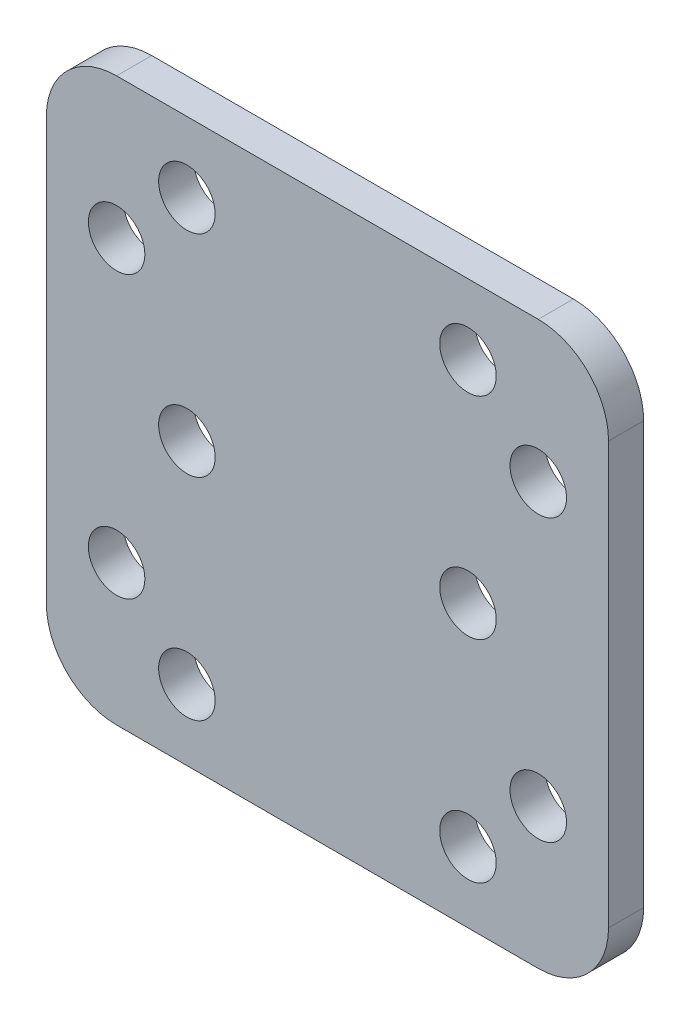
ISO-10303-21;
HEADER;
FILE_DESCRIPTION(('STEP AP214'),'2;1');
FILE_NAME('part.step','',(''),(''),'','','');
FILE_SCHEMA(('AUTOMOTIVE_DESIGN { 1 0 10303 214 1 1 1 1 }'));
ENDSEC;
DATA;
#1=APPLICATION_CONTEXT('core data for automotive mechanical design processes');
#2=APPLICATION_PROTOCOL_DEFINITION('international standard','automotive_design',2000,#1);
#3=PRODUCT_CONTEXT('',#1,'mechanical');
#4=PRODUCT('Part','Part','',(#3));
#5=PRODUCT_RELATED_PRODUCT_CATEGORY('part','',(#4));
#6=PRODUCT_DEFINITION_FORMATION('','',#4);
#7=PRODUCT_DEFINITION_CONTEXT('part definition',#1,'design');
#8=PRODUCT_DEFINITION('design','',#6,#7);
#9=PRODUCT_DEFINITION_SHAPE('','',#8);
#10=(LENGTH_UNIT() NAMED_UNIT(*) SI_UNIT(.MILLI.,.METRE.));
#11=(NAMED_UNIT(*) PLANE_ANGLE_UNIT() SI_UNIT($,.RADIAN.));
#12=(NAMED_UNIT(*) SI_UNIT($,.STERADIAN.) SOLID_ANGLE_UNIT());
#13=UNCERTAINTY_MEASURE_WITH_UNIT(LENGTH_MEASURE(1.E-05),#10,'distance_accuracy_value','');
#14=(GEOMETRIC_REPRESENTATION_CONTEXT(3) GLOBAL_UNCERTAINTY_ASSIGNED_CONTEXT((#13)) GLOBAL_UNIT_ASSIGNED_CONTEXT((#10,
#11,#12)) REPRESENTATION_CONTEXT('',''));
#15=CARTESIAN_POINT('',(0.,0.,0.));
#16=DIRECTION('',(0.,0.,1.));
#17=DIRECTION('',(1.,0.,0.));
#18=AXIS2_PLACEMENT_3D('',#15,#16,#17);
#19=CARTESIAN_POINT('',(6.34999999985809,2.37276864822889E-11,0.));
#20=DIRECTION('',(0.,0.,1.));
#21=DIRECTION('',(1.,0.,0.));
#22=AXIS2_PLACEMENT_3D('',#19,#20,#21);
#23=PLANE('',#22);
#24=CARTESIAN_POINT('',(-12.7000000001419,12.7000000000238,0.));
#25=DIRECTION('',(0.,0.,-1.));
#26=DIRECTION('',(-1.,0.,0.));
#27=AXIS2_PLACEMENT_3D('',#24,#25,#26);
#28=CIRCLE('',#27,2.5527);
#29=CARTESIAN_POINT('',(-10.1473000001419,12.7000000000238,0.));
#30=VERTEX_POINT('',#29);
#31=EDGE_CURVE('E186',#30,#30,#28,.T.);
#32=ORIENTED_EDGE('',*,*,#31,.F.);
#33=EDGE_LOOP('',(#32));
#34=FACE_BOUND('',#33,.T.);
#35=CARTESIAN_POINT('',(-6.35000000014201,19.0500000000238,0.));
#36=DIRECTION('',(0.,0.,-1.));
#37=DIRECTION('',(-1.,0.,0.));
#38=AXIS2_PLACEMENT_3D('',#35,#36,#37);
#39=CIRCLE('',#38,2.5527);
#40=CARTESIAN_POINT('',(-3.79730000014201,19.0500000000238,0.));
#41=VERTEX_POINT('',#40);
#42=EDGE_CURVE('E237',#41,#41,#39,.T.);
#43=ORIENTED_EDGE('',*,*,#42,.F.);
#44=EDGE_LOOP('',(#43));
#45=FACE_BOUND('',#44,.T.);
#46=CARTESIAN_POINT('',(19.0499999998582,19.0500000000238,0.));
#47=DIRECTION('',(0.,0.,-1.));
#48=DIRECTION('',(-1.,0.,0.));
#49=AXIS2_PLACEMENT_3D('',#46,#47,#48);
#50=CIRCLE('',#49,2.5527);
#51=CARTESIAN_POINT('',(21.6026999998582,19.0500000000238,0.));
#52=VERTEX_POINT('',#51);
#53=EDGE_CURVE('E228',#52,#52,#50,.T.);
#54=ORIENTED_EDGE('',*,*,#53,.F.);
#55=EDGE_LOOP('',(#54));
#56=FACE_BOUND('',#55,.T.);
#57=CARTESIAN_POINT('',(19.0499999998582,2.35908870584317E-11,0.));
#58=DIRECTION('',(0.,0.,-1.));
#59=DIRECTION('',(-1.,0.,0.));
#60=AXIS2_PLACEMENT_3D('',#57,#58,#59);
#61=CIRCLE('',#60,2.5527);
#62=CARTESIAN_POINT('',(21.6026999998582,2.35901822884954E-11,0.));
#63=VERTEX_POINT('',#62);
#64=EDGE_CURVE('E270',#63,#63,#61,.T.);
#65=ORIENTED_EDGE('',*,*,#64,.F.);
#66=EDGE_LOOP('',(#65));
#67=FACE_BOUND('',#66,.T.);
#68=CARTESIAN_POINT('',(25.3999999998581,12.7000000000238,0.));
#69=DIRECTION('',(0.,0.,-1.));
#70=DIRECTION('',(-1.,0.,0.));
#71=AXIS2_PLACEMENT_3D('',#68,#69,#70);
#72=CIRCLE('',#71,2.5527);
#73=CARTESIAN_POINT('',(27.952699999858,12.7000000000238,0.));
#74=VERTEX_POINT('',#73);
#75=EDGE_CURVE('E252',#74,#74,#72,.T.);
#76=ORIENTED_EDGE('',*,*,#75,.F.);
#77=EDGE_LOOP('',(#76));
#78=FACE_BOUND('',#77,.T.);
#79=CARTESIAN_POINT('',(25.3999999998581,-12.6999999999764,0.));
#80=DIRECTION('',(0.,0.,-1.));
#81=DIRECTION('',(-1.,0.,0.));
#82=AXIS2_PLACEMENT_3D('',#79,#80,#81);
#83=CIRCLE('',#82,2.5527);
#84=CARTESIAN_POINT('',(27.952699999858,-12.6999999999764,0.));
#85=VERTEX_POINT('',#84);
#86=EDGE_CURVE('E218',#85,#85,#83,.T.);
#87=ORIENTED_EDGE('',*,*,#86,.F.);
#88=EDGE_LOOP('',(#87));
#89=FACE_BOUND('',#88,.T.);
#90=CARTESIAN_POINT('',(19.0499999998582,-19.0499999999764,0.));
#91=DIRECTION('',(0.,0.,-1.));
#92=DIRECTION('',(-1.,0.,0.));
#93=AXIS2_PLACEMENT_3D('',#90,#91,#92);
#94=CIRCLE('',#93,2.5527);
#95=CARTESIAN_POINT('',(21.6026999998582,-19.0499999999764,0.));
#96=VERTEX_POINT('',#95);
#97=EDGE_CURVE('E217',#96,#96,#94,.T.);
#98=ORIENTED_EDGE('',*,*,#97,.F.);
#99=EDGE_LOOP('',(#98));
#100=FACE_BOUND('',#99,.T.);
#101=CARTESIAN_POINT('',(-6.35000000014201,-19.0499999999764,0.));
#102=DIRECTION('',(0.,0.,-1.));
#103=DIRECTION('',(-1.,0.,0.));
#104=AXIS2_PLACEMENT_3D('',#101,#102,#103);
#105=CIRCLE('',#104,2.5527);
#106=CARTESIAN_POINT('',(-3.79730000014201,-19.0499999999764,0.));
#107=VERTEX_POINT('',#106);
#108=EDGE_CURVE('E210',#107,#107,#105,.T.);
#109=ORIENTED_EDGE('',*,*,#108,.F.);
#110=EDGE_LOOP('',(#109));
#111=FACE_BOUND('',#110,.T.);
#112=CARTESIAN_POINT('',(-12.7000000001419,-12.6999999999764,0.));
#113=DIRECTION('',(0.,0.,-1.));
#114=DIRECTION('',(-1.,0.,0.));
#115=AXIS2_PLACEMENT_3D('',#112,#113,#114);
#116=CIRCLE('',#115,2.5527);
#117=CARTESIAN_POINT('',(-10.1473000001419,-12.6999999999764,0.));
#118=VERTEX_POINT('',#117);
#119=EDGE_CURVE('E300',#118,#118,#116,.T.);
#120=ORIENTED_EDGE('',*,*,#119,.F.);
#121=EDGE_LOOP('',(#120));
#122=FACE_BOUND('',#121,.T.);
#123=CARTESIAN_POINT('',(-6.35000000014201,2.35832467290903E-11,0.));
#124=DIRECTION('',(0.,0.,-1.));
#125=DIRECTION('',(-1.,0.,0.));
#126=AXIS2_PLACEMENT_3D('',#123,#124,#125);
#127=CIRCLE('',#126,2.5527);
#128=CARTESIAN_POINT('',(-3.79730000014201,2.35825419591539E-11,0.));
#129=VERTEX_POINT('',#128);
#130=EDGE_CURVE('E315',#129,#129,#127,.T.);
#131=ORIENTED_EDGE('',*,*,#130,.F.);
#132=EDGE_LOOP('',(#131));
#133=FACE_BOUND('',#132,.T.);
#134=DIRECTION('',(1.,0.,0.));
#135=VECTOR('',#134,1.);
#136=CARTESIAN_POINT('',(-12.700000000142,-25.3999999999765,0.));
#137=LINE('',#136,#135);
#138=CARTESIAN_POINT('',(-12.700000000142,-25.3999999999765,0.));
#139=VERTEX_POINT('',#138);
#140=CARTESIAN_POINT('',(25.3999999998581,-25.3999999999764,0.));
#141=VERTEX_POINT('',#140);
#142=EDGE_CURVE('E25',#139,#141,#137,.T.);
#143=ORIENTED_EDGE('',*,*,#142,.F.);
#144=CARTESIAN_POINT('',(-12.7000000001419,-19.0499999999764,0.));
#145=DIRECTION('',(0.,0.,1.));
#146=DIRECTION('',(-1.,0.,0.));
#147=AXIS2_PLACEMENT_3D('',#144,#145,#146);
#148=CIRCLE('',#147,6.35);
#149=CARTESIAN_POINT('',(-19.0500000001419,-19.0499999999763,0.));
#150=VERTEX_POINT('',#149);
#151=EDGE_CURVE('E318',#150,#139,#148,.T.);
#152=ORIENTED_EDGE('',*,*,#151,.F.);
#153=DIRECTION('',(0.,-1.,0.));
#154=VECTOR('',#153,1.);
#155=CARTESIAN_POINT('',(-19.0500000001419,19.0500000000237,0.));
#156=LINE('',#155,#154);
#157=CARTESIAN_POINT('',(-19.0500000001419,19.0500000000237,0.));
#158=VERTEX_POINT('',#157);
#159=EDGE_CURVE('E258',#158,#150,#156,.T.);
#160=ORIENTED_EDGE('',*,*,#159,.F.);
#161=CARTESIAN_POINT('',(-12.7000000001419,19.0500000000238,0.));
#162=DIRECTION('',(0.,0.,1.));
#163=DIRECTION('',(0.,1.,0.));
#164=AXIS2_PLACEMENT_3D('',#161,#162,#163);
#165=CIRCLE('',#164,6.35);
#166=CARTESIAN_POINT('',(-12.700000000142,25.4000000000238,0.));
#167=VERTEX_POINT('',#166);
#168=EDGE_CURVE('E339',#167,#158,#165,.T.);
#169=ORIENTED_EDGE('',*,*,#168,.F.);
#170=DIRECTION('',(-1.,0.,0.));
#171=VECTOR('',#170,1.);
#172=CARTESIAN_POINT('',(25.3999999998582,25.4000000000238,0.));
#173=LINE('',#172,#171);
#174=CARTESIAN_POINT('',(25.3999999998582,25.4000000000238,0.));
#175=VERTEX_POINT('',#174);
#176=EDGE_CURVE('E199',#175,#167,#173,.T.);
#177=ORIENTED_EDGE('',*,*,#176,.F.);
#178=CARTESIAN_POINT('',(25.3999999998581,19.0500000000238,0.));
#179=DIRECTION('',(0.,0.,1.));
#180=DIRECTION('',(1.,0.,0.));
#181=AXIS2_PLACEMENT_3D('',#178,#179,#180);
#182=CIRCLE('',#181,6.35);
#183=CARTESIAN_POINT('',(31.749999999858,19.0500000000238,0.));
#184=VERTEX_POINT('',#183);
#185=EDGE_CURVE('E352',#184,#175,#182,.T.);
#186=ORIENTED_EDGE('',*,*,#185,.F.);
#187=DIRECTION('',(0.,1.,0.));
#188=VECTOR('',#187,1.);
#189=CARTESIAN_POINT('',(31.749999999858,-19.0499999999764,0.));
#190=LINE('',#189,#188);
#191=CARTESIAN_POINT('',(31.749999999858,-19.0499999999764,0.));
#192=VERTEX_POINT('',#191);
#193=EDGE_CURVE('E322',#192,#184,#190,.T.);
#194=ORIENTED_EDGE('',*,*,#193,.F.);
#195=CARTESIAN_POINT('',(25.3999999998581,-19.0499999999764,0.));
#196=DIRECTION('',(0.,0.,1.));
#197=DIRECTION('',(0.,-1.,0.));
#198=AXIS2_PLACEMENT_3D('',#195,#196,#197);
#199=CIRCLE('',#198,6.35);
#200=EDGE_CURVE('E241',#141,#192,#199,.T.);
#201=ORIENTED_EDGE('',*,*,#200,.F.);
#202=EDGE_LOOP('',(#143,#152,#160,#169,#177,#186,#194,#201));
#203=FACE_BOUND('',#202,.T.);
#204=ADVANCED_FACE('F17',(#34,#45,#56,#67,#78,#89,#100,#111,#122,#133,#203),#23,.F.);
#205=CARTESIAN_POINT('',(6.34999999985809,2.37276864822889E-11,3.175));
#206=DIRECTION('',(0.,0.,1.));
#207=DIRECTION('',(1.,0.,0.));
#208=AXIS2_PLACEMENT_3D('',#205,#206,#207);
#209=PLANE('',#208);
#210=CARTESIAN_POINT('',(-12.7000000001419,12.7000000000238,3.175));
#211=DIRECTION('',(0.,0.,-1.));
#212=DIRECTION('',(-1.,0.,0.));
#213=AXIS2_PLACEMENT_3D('',#210,#211,#212);
#214=CIRCLE('',#213,2.5527);
#215=CARTESIAN_POINT('',(-10.1473000001419,12.7000000000238,3.175));
#216=VERTEX_POINT('',#215);
#217=EDGE_CURVE('E184',#216,#216,#214,.T.);
#218=ORIENTED_EDGE('',*,*,#217,.T.);
#219=EDGE_LOOP('',(#218));
#220=FACE_BOUND('',#219,.T.);
#221=CARTESIAN_POINT('',(-6.35000000014201,19.0500000000238,3.175));
#222=DIRECTION('',(0.,0.,-1.));
#223=DIRECTION('',(-1.,0.,0.));
#224=AXIS2_PLACEMENT_3D('',#221,#222,#223);
#225=CIRCLE('',#224,2.5527);
#226=CARTESIAN_POINT('',(-3.79730000014201,19.0500000000238,3.175));
#227=VERTEX_POINT('',#226);
#228=EDGE_CURVE('E229',#227,#227,#225,.T.);
#229=ORIENTED_EDGE('',*,*,#228,.T.);
#230=EDGE_LOOP('',(#229));
#231=FACE_BOUND('',#230,.T.);
#232=CARTESIAN_POINT('',(19.0499999998582,19.0500000000238,3.175));
#233=DIRECTION('',(0.,0.,-1.));
#234=DIRECTION('',(-1.,0.,0.));
#235=AXIS2_PLACEMENT_3D('',#232,#233,#234);
#236=CIRCLE('',#235,2.5527);
#237=CARTESIAN_POINT('',(21.6026999998582,19.0500000000238,3.175));
#238=VERTEX_POINT('',#237);
#239=EDGE_CURVE('E240',#238,#238,#236,.T.);
#240=ORIENTED_EDGE('',*,*,#239,.T.);
#241=EDGE_LOOP('',(#240));
#242=FACE_BOUND('',#241,.T.);
#243=CARTESIAN_POINT('',(19.0499999998582,2.35908870584317E-11,3.175));
#244=DIRECTION('',(0.,0.,-1.));
#245=DIRECTION('',(-1.,0.,0.));
#246=AXIS2_PLACEMENT_3D('',#243,#244,#245);
#247=CIRCLE('',#246,2.5527);
#248=CARTESIAN_POINT('',(21.6026999998582,2.35900188272353E-11,3.175));
#249=VERTEX_POINT('',#248);
#250=EDGE_CURVE('E223',#249,#249,#247,.T.);
#251=ORIENTED_EDGE('',*,*,#250,.T.);
#252=EDGE_LOOP('',(#251));
#253=FACE_BOUND('',#252,.T.);
#254=CARTESIAN_POINT('',(25.3999999998581,12.7000000000238,3.175));
#255=DIRECTION('',(0.,0.,-1.));
#256=DIRECTION('',(-1.,0.,0.));
#257=AXIS2_PLACEMENT_3D('',#254,#255,#256);
#258=CIRCLE('',#257,2.5527);
#259=CARTESIAN_POINT('',(27.952699999858,12.7000000000238,3.175));
#260=VERTEX_POINT('',#259);
#261=EDGE_CURVE('E253',#260,#260,#258,.T.);
#262=ORIENTED_EDGE('',*,*,#261,.T.);
#263=EDGE_LOOP('',(#262));
#264=FACE_BOUND('',#263,.T.);
#265=CARTESIAN_POINT('',(25.3999999998581,-12.6999999999764,3.175));
#266=DIRECTION('',(0.,0.,-1.));
#267=DIRECTION('',(-1.,0.,0.));
#268=AXIS2_PLACEMENT_3D('',#265,#266,#267);
#269=CIRCLE('',#268,2.5527);
#270=CARTESIAN_POINT('',(27.952699999858,-12.6999999999764,3.175));
#271=VERTEX_POINT('',#270);
#272=EDGE_CURVE('E275',#271,#271,#269,.T.);
#273=ORIENTED_EDGE('',*,*,#272,.T.);
#274=EDGE_LOOP('',(#273));
#275=FACE_BOUND('',#274,.T.);
#276=CARTESIAN_POINT('',(19.0499999998582,-19.0499999999764,3.175));
#277=DIRECTION('',(0.,0.,-1.));
#278=DIRECTION('',(-1.,0.,0.));
#279=AXIS2_PLACEMENT_3D('',#276,#277,#278);
#280=CIRCLE('',#279,2.5527);
#281=CARTESIAN_POINT('',(21.6026999998582,-19.0499999999764,3.175));
#282=VERTEX_POINT('',#281);
#283=EDGE_CURVE('E221',#282,#282,#280,.T.);
#284=ORIENTED_EDGE('',*,*,#283,.T.);
#285=EDGE_LOOP('',(#284));
#286=FACE_BOUND('',#285,.T.);
#287=CARTESIAN_POINT('',(-6.35000000014201,-19.0499999999764,3.175));
#288=DIRECTION('',(0.,0.,-1.));
#289=DIRECTION('',(-1.,0.,0.));
#290=AXIS2_PLACEMENT_3D('',#287,#288,#289);
#291=CIRCLE('',#290,2.5527);
#292=CARTESIAN_POINT('',(-3.79730000014201,-19.0499999999764,3.175));
#293=VERTEX_POINT('',#292);
#294=EDGE_CURVE('E212',#293,#293,#291,.T.);
#295=ORIENTED_EDGE('',*,*,#294,.T.);
#296=EDGE_LOOP('',(#295));
#297=FACE_BOUND('',#296,.T.);
#298=CARTESIAN_POINT('',(-12.7000000001419,-12.6999999999764,3.175));
#299=DIRECTION('',(0.,0.,-1.));
#300=DIRECTION('',(-1.,0.,0.));
#301=AXIS2_PLACEMENT_3D('',#298,#299,#300);
#302=CIRCLE('',#301,2.5527);
#303=CARTESIAN_POINT('',(-10.1473000001419,-12.6999999999764,3.175));
#304=VERTEX_POINT('',#303);
#305=EDGE_CURVE('E206',#304,#304,#302,.T.);
#306=ORIENTED_EDGE('',*,*,#305,.T.);
#307=EDGE_LOOP('',(#306));
#308=FACE_BOUND('',#307,.T.);
#309=CARTESIAN_POINT('',(-6.35000000014201,2.35832467290903E-11,3.175));
#310=DIRECTION('',(0.,0.,-1.));
#311=DIRECTION('',(-1.,0.,0.));
#312=AXIS2_PLACEMENT_3D('',#309,#310,#311);
#313=CIRCLE('',#312,2.5527);
#314=CARTESIAN_POINT('',(-3.79730000014201,2.35811370430383E-11,3.175));
#315=VERTEX_POINT('',#314);
#316=EDGE_CURVE('E303',#315,#315,#313,.T.);
#317=ORIENTED_EDGE('',*,*,#316,.T.);
#318=EDGE_LOOP('',(#317));
#319=FACE_BOUND('',#318,.T.);
#320=DIRECTION('',(1.,0.,0.));
#321=VECTOR('',#320,1.);
#322=CARTESIAN_POINT('',(-12.700000000142,-25.3999999999765,3.175));
#323=LINE('',#322,#321);
#324=CARTESIAN_POINT('',(-12.700000000142,-25.3999999999765,3.175));
#325=VERTEX_POINT('',#324);
#326=CARTESIAN_POINT('',(25.3999999998581,-25.3999999999764,3.175));
#327=VERTEX_POINT('',#326);
#328=EDGE_CURVE('E11',#325,#327,#323,.T.);
#329=ORIENTED_EDGE('',*,*,#328,.T.);
#330=CARTESIAN_POINT('',(25.3999999998581,-19.0499999999764,3.175));
#331=DIRECTION('',(0.,0.,1.));
#332=DIRECTION('',(0.,-1.,0.));
#333=AXIS2_PLACEMENT_3D('',#330,#331,#332);
#334=CIRCLE('',#333,6.35);
#335=CARTESIAN_POINT('',(31.749999999858,-19.0499999999764,3.175));
#336=VERTEX_POINT('',#335);
#337=EDGE_CURVE('E244',#327,#336,#334,.T.);
#338=ORIENTED_EDGE('',*,*,#337,.T.);
#339=DIRECTION('',(0.,1.,0.));
#340=VECTOR('',#339,1.);
#341=CARTESIAN_POINT('',(31.749999999858,-19.0499999999764,3.175));
#342=LINE('',#341,#340);
#343=CARTESIAN_POINT('',(31.749999999858,19.0500000000238,3.175));
#344=VERTEX_POINT('',#343);
#345=EDGE_CURVE('E325',#336,#344,#342,.T.);
#346=ORIENTED_EDGE('',*,*,#345,.T.);
#347=CARTESIAN_POINT('',(25.3999999998581,19.0500000000238,3.175));
#348=DIRECTION('',(0.,0.,1.));
#349=DIRECTION('',(1.,0.,0.));
#350=AXIS2_PLACEMENT_3D('',#347,#348,#349);
#351=CIRCLE('',#350,6.35);
#352=CARTESIAN_POINT('',(25.3999999998582,25.4000000000238,3.175));
#353=VERTEX_POINT('',#352);
#354=EDGE_CURVE('E355',#344,#353,#351,.T.);
#355=ORIENTED_EDGE('',*,*,#354,.T.);
#356=DIRECTION('',(-1.,0.,0.));
#357=VECTOR('',#356,1.);
#358=CARTESIAN_POINT('',(25.3999999998582,25.4000000000238,3.175));
#359=LINE('',#358,#357);
#360=CARTESIAN_POINT('',(-12.700000000142,25.4000000000238,3.175));
#361=VERTEX_POINT('',#360);
#362=EDGE_CURVE('E308',#353,#361,#359,.T.);
#363=ORIENTED_EDGE('',*,*,#362,.T.);
#364=CARTESIAN_POINT('',(-12.7000000001419,19.0500000000238,3.175));
#365=DIRECTION('',(0.,0.,1.));
#366=DIRECTION('',(0.,1.,0.));
#367=AXIS2_PLACEMENT_3D('',#364,#365,#366);
#368=CIRCLE('',#367,6.35);
#369=CARTESIAN_POINT('',(-19.0500000001419,19.0500000000237,3.175));
#370=VERTEX_POINT('',#369);
#371=EDGE_CURVE('E342',#361,#370,#368,.T.);
#372=ORIENTED_EDGE('',*,*,#371,.T.);
#373=DIRECTION('',(0.,-1.,0.));
#374=VECTOR('',#373,1.);
#375=CARTESIAN_POINT('',(-19.0500000001419,19.0500000000237,3.175));
#376=LINE('',#375,#374);
#377=CARTESIAN_POINT('',(-19.0500000001419,-19.0499999999763,3.175));
#378=VERTEX_POINT('',#377);
#379=EDGE_CURVE('E261',#370,#378,#376,.T.);
#380=ORIENTED_EDGE('',*,*,#379,.T.);
#381=CARTESIAN_POINT('',(-12.7000000001419,-19.0499999999764,3.175));
#382=DIRECTION('',(0.,0.,1.));
#383=DIRECTION('',(-1.,0.,0.));
#384=AXIS2_PLACEMENT_3D('',#381,#382,#383);
#385=CIRCLE('',#384,6.35);
#386=EDGE_CURVE('E201',#378,#325,#385,.T.);
#387=ORIENTED_EDGE('',*,*,#386,.T.);
#388=EDGE_LOOP('',(#329,#338,#346,#355,#363,#372,#380,#387));
#389=FACE_BOUND('',#388,.T.);
#390=ADVANCED_FACE('F190',(#220,#231,#242,#253,#264,#275,#286,#297,#308,#319,#389),#209,.T.);
#391=CARTESIAN_POINT('',(-12.700000000142,-25.3999999999765,0.));
#392=DIRECTION('',(0.,-1.,0.));
#393=DIRECTION('',(0.,0.,-1.));
#394=AXIS2_PLACEMENT_3D('',#391,#392,#393);
#395=PLANE('',#394);
#396=ORIENTED_EDGE('',*,*,#142,.T.);
#397=DIRECTION('',(0.,0.,1.));
#398=VECTOR('',#397,1.);
#399=CARTESIAN_POINT('',(25.3999999998581,-25.3999999999764,0.));
#400=LINE('',#399,#398);
#401=EDGE_CURVE('E321',#141,#327,#400,.T.);
#402=ORIENTED_EDGE('',*,*,#401,.T.);
#403=ORIENTED_EDGE('',*,*,#328,.F.);
#404=DIRECTION('',(0.,0.,1.));
#405=VECTOR('',#404,1.);
#406=CARTESIAN_POINT('',(-12.700000000142,-25.3999999999765,0.));
#407=LINE('',#406,#405);
#408=EDGE_CURVE('E205',#139,#325,#407,.T.);
#409=ORIENTED_EDGE('',*,*,#408,.F.);
#410=EDGE_LOOP('',(#396,#402,#403,#409));
#411=FACE_BOUND('',#410,.T.);
#412=ADVANCED_FACE('F559',(#411),#395,.T.);
#413=CARTESIAN_POINT('',(25.3999999998581,-19.0499999999764,0.));
#414=DIRECTION('',(0.,0.,1.));
#415=DIRECTION('',(0.,-1.,0.));
#416=AXIS2_PLACEMENT_3D('',#413,#414,#415);
#417=CYLINDRICAL_SURFACE('',#416,6.35);
#418=ORIENTED_EDGE('',*,*,#200,.T.);
#419=DIRECTION('',(0.,0.,1.));
#420=VECTOR('',#419,1.);
#421=CARTESIAN_POINT('',(31.749999999858,-19.0499999999764,0.));
#422=LINE('',#421,#420);
#423=EDGE_CURVE('E245',#192,#336,#422,.T.);
#424=ORIENTED_EDGE('',*,*,#423,.T.);
#425=ORIENTED_EDGE('',*,*,#337,.F.);
#426=ORIENTED_EDGE('',*,*,#401,.F.);
#427=EDGE_LOOP('',(#418,#424,#425,#426));
#428=FACE_BOUND('',#427,.T.);
#429=ADVANCED_FACE('F589',(#428),#417,.T.);
#430=CARTESIAN_POINT('',(31.749999999858,-19.0499999999764,0.));
#431=DIRECTION('',(1.,0.,0.));
#432=DIRECTION('',(0.,-1.,0.));
#433=AXIS2_PLACEMENT_3D('',#430,#431,#432);
#434=PLANE('',#433);
#435=ORIENTED_EDGE('',*,*,#193,.T.);
#436=DIRECTION('',(0.,0.,1.));
#437=VECTOR('',#436,1.);
#438=CARTESIAN_POINT('',(31.749999999858,19.0500000000238,0.));
#439=LINE('',#438,#437);
#440=EDGE_CURVE('E326',#184,#344,#439,.T.);
#441=ORIENTED_EDGE('',*,*,#440,.T.);
#442=ORIENTED_EDGE('',*,*,#345,.F.);
#443=ORIENTED_EDGE('',*,*,#423,.F.);
#444=EDGE_LOOP('',(#435,#441,#442,#443));
#445=FACE_BOUND('',#444,.T.);
#446=ADVANCED_FACE('F585',(#445),#434,.T.);
#447=CARTESIAN_POINT('',(25.3999999998581,19.0500000000238,0.));
#448=DIRECTION('',(0.,0.,1.));
#449=DIRECTION('',(1.,0.,0.));
#450=AXIS2_PLACEMENT_3D('',#447,#448,#449);
#451=CYLINDRICAL_SURFACE('',#450,6.35);
#452=ORIENTED_EDGE('',*,*,#185,.T.);
#453=DIRECTION('',(0.,0.,1.));
#454=VECTOR('',#453,1.);
#455=CARTESIAN_POINT('',(25.3999999998582,25.4000000000238,0.));
#456=LINE('',#455,#454);
#457=EDGE_CURVE('E311',#175,#353,#456,.T.);
#458=ORIENTED_EDGE('',*,*,#457,.T.);
#459=ORIENTED_EDGE('',*,*,#354,.F.);
#460=ORIENTED_EDGE('',*,*,#440,.F.);
#461=EDGE_LOOP('',(#452,#458,#459,#460));
#462=FACE_BOUND('',#461,.T.);
#463=ADVANCED_FACE('F581',(#462),#451,.T.);
#464=CARTESIAN_POINT('',(25.3999999998582,25.4000000000238,0.));
#465=DIRECTION('',(0.,1.,0.));
#466=DIRECTION('',(1.,0.,0.));
#467=AXIS2_PLACEMENT_3D('',#464,#465,#466);
#468=PLANE('',#467);
#469=ORIENTED_EDGE('',*,*,#176,.T.);
#470=DIRECTION('',(0.,0.,1.));
#471=VECTOR('',#470,1.);
#472=CARTESIAN_POINT('',(-12.700000000142,25.4000000000238,0.));
#473=LINE('',#472,#471);
#474=EDGE_CURVE('E345',#167,#361,#473,.T.);
#475=ORIENTED_EDGE('',*,*,#474,.T.);
#476=ORIENTED_EDGE('',*,*,#362,.F.);
#477=ORIENTED_EDGE('',*,*,#457,.F.);
#478=EDGE_LOOP('',(#469,#475,#476,#477));
#479=FACE_BOUND('',#478,.T.);
#480=ADVANCED_FACE('F577',(#479),#468,.T.);
#481=CARTESIAN_POINT('',(-12.7000000001419,19.0500000000238,0.));
#482=DIRECTION('',(0.,0.,1.));
#483=DIRECTION('',(0.,1.,0.));
#484=AXIS2_PLACEMENT_3D('',#481,#482,#483);
#485=CYLINDRICAL_SURFACE('',#484,6.35);
#486=ORIENTED_EDGE('',*,*,#168,.T.);
#487=DIRECTION('',(0.,0.,1.));
#488=VECTOR('',#487,1.);
#489=CARTESIAN_POINT('',(-19.0500000001419,19.0500000000237,0.));
#490=LINE('',#489,#488);
#491=EDGE_CURVE('E278',#158,#370,#490,.T.);
#492=ORIENTED_EDGE('',*,*,#491,.T.);
#493=ORIENTED_EDGE('',*,*,#371,.F.);
#494=ORIENTED_EDGE('',*,*,#474,.F.);
#495=EDGE_LOOP('',(#486,#492,#493,#494));
#496=FACE_BOUND('',#495,.T.);
#497=ADVANCED_FACE('F573',(#496),#485,.T.);
#498=CARTESIAN_POINT('',(-19.0500000001419,19.0500000000237,0.));
#499=DIRECTION('',(-1.,0.,0.));
#500=DIRECTION('',(0.,1.,0.));
#501=AXIS2_PLACEMENT_3D('',#498,#499,#500);
#502=PLANE('',#501);
#503=ORIENTED_EDGE('',*,*,#159,.T.);
#504=DIRECTION('',(0.,0.,1.));
#505=VECTOR('',#504,1.);
#506=CARTESIAN_POINT('',(-19.0500000001419,-19.0499999999763,0.));
#507=LINE('',#506,#505);
#508=EDGE_CURVE('E204',#150,#378,#507,.T.);
#509=ORIENTED_EDGE('',*,*,#508,.T.);
#510=ORIENTED_EDGE('',*,*,#379,.F.);
#511=ORIENTED_EDGE('',*,*,#491,.F.);
#512=EDGE_LOOP('',(#503,#509,#510,#511));
#513=FACE_BOUND('',#512,.T.);
#514=ADVANCED_FACE('F566',(#513),#502,.T.);
#515=CARTESIAN_POINT('',(-12.7000000001419,-19.0499999999764,0.));
#516=DIRECTION('',(0.,0.,1.));
#517=DIRECTION('',(-1.,0.,0.));
#518=AXIS2_PLACEMENT_3D('',#515,#516,#517);
#519=CYLINDRICAL_SURFACE('',#518,6.35);
#520=ORIENTED_EDGE('',*,*,#151,.T.);
#521=ORIENTED_EDGE('',*,*,#408,.T.);
#522=ORIENTED_EDGE('',*,*,#386,.F.);
#523=ORIENTED_EDGE('',*,*,#508,.F.);
#524=EDGE_LOOP('',(#520,#521,#522,#523));
#525=FACE_BOUND('',#524,.T.);
#526=ADVANCED_FACE('F563',(#525),#519,.T.);
#527=CARTESIAN_POINT('',(-6.35000000014201,2.35832467290903E-11,0.));
#528=DIRECTION('',(0.,0.,1.));
#529=DIRECTION('',(-1.,0.,0.));
#530=AXIS2_PLACEMENT_3D('',#527,#528,#529);
#531=CYLINDRICAL_SURFACE('',#530,2.5527);
#532=ORIENTED_EDGE('',*,*,#316,.F.);
#533=DIRECTION('',(0.,0.,-1.));
#534=VECTOR('',#533,1.);
#535=CARTESIAN_POINT('',(-3.79730000014201,2.35825419591539E-11,0.));
#536=LINE('',#535,#534);
#537=EDGE_CURVE('E307',#315,#129,#536,.T.);
#538=ORIENTED_EDGE('',*,*,#537,.T.);
#539=ORIENTED_EDGE('',*,*,#130,.T.);
#540=ORIENTED_EDGE('',*,*,#537,.F.);
#541=EDGE_LOOP('',(#532,#538,#539,#540));
#542=FACE_BOUND('',#541,.T.);
#543=ADVANCED_FACE('F608',(#542),#531,.F.);
#544=CARTESIAN_POINT('',(-12.7000000001419,-12.6999999999764,0.));
#545=DIRECTION('',(0.,0.,1.));
#546=DIRECTION('',(-1.,0.,0.));
#547=AXIS2_PLACEMENT_3D('',#544,#545,#546);
#548=CYLINDRICAL_SURFACE('',#547,2.5527);
#549=ORIENTED_EDGE('',*,*,#305,.F.);
#550=DIRECTION('',(0.,0.,-1.));
#551=VECTOR('',#550,1.);
#552=CARTESIAN_POINT('',(-10.1473000001419,-12.6999999999764,0.));
#553=LINE('',#552,#551);
#554=EDGE_CURVE('E209',#304,#118,#553,.T.);
#555=ORIENTED_EDGE('',*,*,#554,.T.);
#556=ORIENTED_EDGE('',*,*,#119,.T.);
#557=ORIENTED_EDGE('',*,*,#554,.F.);
#558=EDGE_LOOP('',(#549,#555,#556,#557));
#559=FACE_BOUND('',#558,.T.);
#560=ADVANCED_FACE('F613',(#559),#548,.F.);
#561=CARTESIAN_POINT('',(-6.35000000014201,-19.0499999999764,0.));
#562=DIRECTION('',(0.,0.,1.));
#563=DIRECTION('',(-1.,0.,0.));
#564=AXIS2_PLACEMENT_3D('',#561,#562,#563);
#565=CYLINDRICAL_SURFACE('',#564,2.5527);
#566=ORIENTED_EDGE('',*,*,#294,.F.);
#567=DIRECTION('',(0.,0.,-1.));
#568=VECTOR('',#567,1.);
#569=CARTESIAN_POINT('',(-3.79730000014201,-19.0499999999764,0.));
#570=LINE('',#569,#568);
#571=EDGE_CURVE('E216',#293,#107,#570,.T.);
#572=ORIENTED_EDGE('',*,*,#571,.T.);
#573=ORIENTED_EDGE('',*,*,#108,.T.);
#574=ORIENTED_EDGE('',*,*,#571,.F.);
#575=EDGE_LOOP('',(#566,#572,#573,#574));
#576=FACE_BOUND('',#575,.T.);
#577=ADVANCED_FACE('F609',(#576),#565,.F.);
#578=CARTESIAN_POINT('',(19.0499999998582,-19.0499999999764,0.));
#579=DIRECTION('',(0.,0.,1.));
#580=DIRECTION('',(-1.,0.,0.));
#581=AXIS2_PLACEMENT_3D('',#578,#579,#580);
#582=CYLINDRICAL_SURFACE('',#581,2.5527);
#583=ORIENTED_EDGE('',*,*,#283,.F.);
#584=DIRECTION('',(0.,0.,-1.));
#585=VECTOR('',#584,1.);
#586=CARTESIAN_POINT('',(21.6026999998582,-19.0499999999764,0.));
#587=LINE('',#586,#585);
#588=EDGE_CURVE('E288',#282,#96,#587,.T.);
#589=ORIENTED_EDGE('',*,*,#588,.T.);
#590=ORIENTED_EDGE('',*,*,#97,.T.);
#591=ORIENTED_EDGE('',*,*,#588,.F.);
#592=EDGE_LOOP('',(#583,#589,#590,#591));
#593=FACE_BOUND('',#592,.T.);
#594=ADVANCED_FACE('F612',(#593),#582,.F.);
#595=CARTESIAN_POINT('',(25.3999999998581,-12.6999999999764,0.));
#596=DIRECTION('',(0.,0.,1.));
#597=DIRECTION('',(-1.,0.,0.));
#598=AXIS2_PLACEMENT_3D('',#595,#596,#597);
#599=CYLINDRICAL_SURFACE('',#598,2.5527);
#600=ORIENTED_EDGE('',*,*,#272,.F.);
#601=DIRECTION('',(0.,0.,-1.));
#602=VECTOR('',#601,1.);
#603=CARTESIAN_POINT('',(27.952699999858,-12.6999999999764,0.));
#604=LINE('',#603,#602);
#605=EDGE_CURVE('E222',#271,#85,#604,.T.);
#606=ORIENTED_EDGE('',*,*,#605,.T.);
#607=ORIENTED_EDGE('',*,*,#86,.T.);
#608=ORIENTED_EDGE('',*,*,#605,.F.);
#609=EDGE_LOOP('',(#600,#606,#607,#608));
#610=FACE_BOUND('',#609,.T.);
#611=ADVANCED_FACE('F617',(#610),#599,.F.);
#612=CARTESIAN_POINT('',(25.3999999998581,12.7000000000238,0.));
#613=DIRECTION('',(0.,0.,1.));
#614=DIRECTION('',(-1.,0.,0.));
#615=AXIS2_PLACEMENT_3D('',#612,#613,#614);
#616=CYLINDRICAL_SURFACE('',#615,2.5527);
#617=ORIENTED_EDGE('',*,*,#261,.F.);
#618=DIRECTION('',(0.,0.,-1.));
#619=VECTOR('',#618,1.);
#620=CARTESIAN_POINT('',(27.952699999858,12.7000000000238,0.));
#621=LINE('',#620,#619);
#622=EDGE_CURVE('E248',#260,#74,#621,.T.);
#623=ORIENTED_EDGE('',*,*,#622,.T.);
#624=ORIENTED_EDGE('',*,*,#75,.T.);
#625=ORIENTED_EDGE('',*,*,#622,.F.);
#626=EDGE_LOOP('',(#617,#623,#624,#625));
#627=FACE_BOUND('',#626,.T.);
#628=ADVANCED_FACE('F539',(#627),#616,.F.);
#629=CARTESIAN_POINT('',(19.0499999998582,2.35908870584317E-11,0.));
#630=DIRECTION('',(0.,0.,1.));
#631=DIRECTION('',(-1.,0.,0.));
#632=AXIS2_PLACEMENT_3D('',#629,#630,#631);
#633=CYLINDRICAL_SURFACE('',#632,2.5527);
#634=ORIENTED_EDGE('',*,*,#250,.F.);
#635=DIRECTION('',(0.,0.,-1.));
#636=VECTOR('',#635,1.);
#637=CARTESIAN_POINT('',(21.6026999998582,2.35901822884954E-11,0.));
#638=LINE('',#637,#636);
#639=EDGE_CURVE('E227',#249,#63,#638,.T.);
#640=ORIENTED_EDGE('',*,*,#639,.T.);
#641=ORIENTED_EDGE('',*,*,#64,.T.);
#642=ORIENTED_EDGE('',*,*,#639,.F.);
#643=EDGE_LOOP('',(#634,#640,#641,#642));
#644=FACE_BOUND('',#643,.T.);
#645=ADVANCED_FACE('F626',(#644),#633,.F.);
#646=CARTESIAN_POINT('',(19.0499999998582,19.0500000000238,0.));
#647=DIRECTION('',(0.,0.,1.));
#648=DIRECTION('',(-1.,0.,0.));
#649=AXIS2_PLACEMENT_3D('',#646,#647,#648);
#650=CYLINDRICAL_SURFACE('',#649,2.5527);
#651=ORIENTED_EDGE('',*,*,#239,.F.);
#652=DIRECTION('',(0.,0.,-1.));
#653=VECTOR('',#652,1.);
#654=CARTESIAN_POINT('',(21.6026999998582,19.0500000000238,0.));
#655=LINE('',#654,#653);
#656=EDGE_CURVE('E257',#238,#52,#655,.T.);
#657=ORIENTED_EDGE('',*,*,#656,.T.);
#658=ORIENTED_EDGE('',*,*,#53,.T.);
#659=ORIENTED_EDGE('',*,*,#656,.F.);
#660=EDGE_LOOP('',(#651,#657,#658,#659));
#661=FACE_BOUND('',#660,.T.);
#662=ADVANCED_FACE('F635',(#661),#650,.F.);
#663=CARTESIAN_POINT('',(-6.35000000014201,19.0500000000238,0.));
#664=DIRECTION('',(0.,0.,1.));
#665=DIRECTION('',(-1.,0.,0.));
#666=AXIS2_PLACEMENT_3D('',#663,#664,#665);
#667=CYLINDRICAL_SURFACE('',#666,2.5527);
#668=ORIENTED_EDGE('',*,*,#228,.F.);
#669=DIRECTION('',(0.,0.,-1.));
#670=VECTOR('',#669,1.);
#671=CARTESIAN_POINT('',(-3.79730000014201,19.0500000000238,0.));
#672=LINE('',#671,#670);
#673=EDGE_CURVE('E233',#227,#41,#672,.T.);
#674=ORIENTED_EDGE('',*,*,#673,.T.);
#675=ORIENTED_EDGE('',*,*,#42,.T.);
#676=ORIENTED_EDGE('',*,*,#673,.F.);
#677=EDGE_LOOP('',(#668,#674,#675,#676));
#678=FACE_BOUND('',#677,.T.);
#679=ADVANCED_FACE('F639',(#678),#667,.F.);
#680=CARTESIAN_POINT('',(-12.7000000001419,12.7000000000238,0.));
#681=DIRECTION('',(0.,0.,1.));
#682=DIRECTION('',(-1.,0.,0.));
#683=AXIS2_PLACEMENT_3D('',#680,#681,#682);
#684=CYLINDRICAL_SURFACE('',#683,2.5527);
#685=ORIENTED_EDGE('',*,*,#217,.F.);
#686=DIRECTION('',(0.,0.,-1.));
#687=VECTOR('',#686,1.);
#688=CARTESIAN_POINT('',(-10.1473000001419,12.7000000000238,0.));
#689=LINE('',#688,#687);
#690=EDGE_CURVE('E181',#216,#30,#689,.T.);
#691=ORIENTED_EDGE('',*,*,#690,.T.);
#692=ORIENTED_EDGE('',*,*,#31,.T.);
#693=ORIENTED_EDGE('',*,*,#690,.F.);
#694=EDGE_LOOP('',(#685,#691,#692,#693));
#695=FACE_BOUND('',#694,.T.);
#696=ADVANCED_FACE('F183',(#695),#684,.F.);
#697=CLOSED_SHELL('',(#204,#390,#412,#429,#446,#463,#480,#497,#514,#526,#543,#560,#577,#594,
#611,#628,#645,#662,#679,#696));
#698=MANIFOLD_SOLID_BREP('B1',#697);
#699=ADVANCED_BREP_SHAPE_REPRESENTATION('',(#18,#698),#14);
#700=SHAPE_DEFINITION_REPRESENTATION(#9,#699);
ENDSEC;
END-ISO-10303-21;
